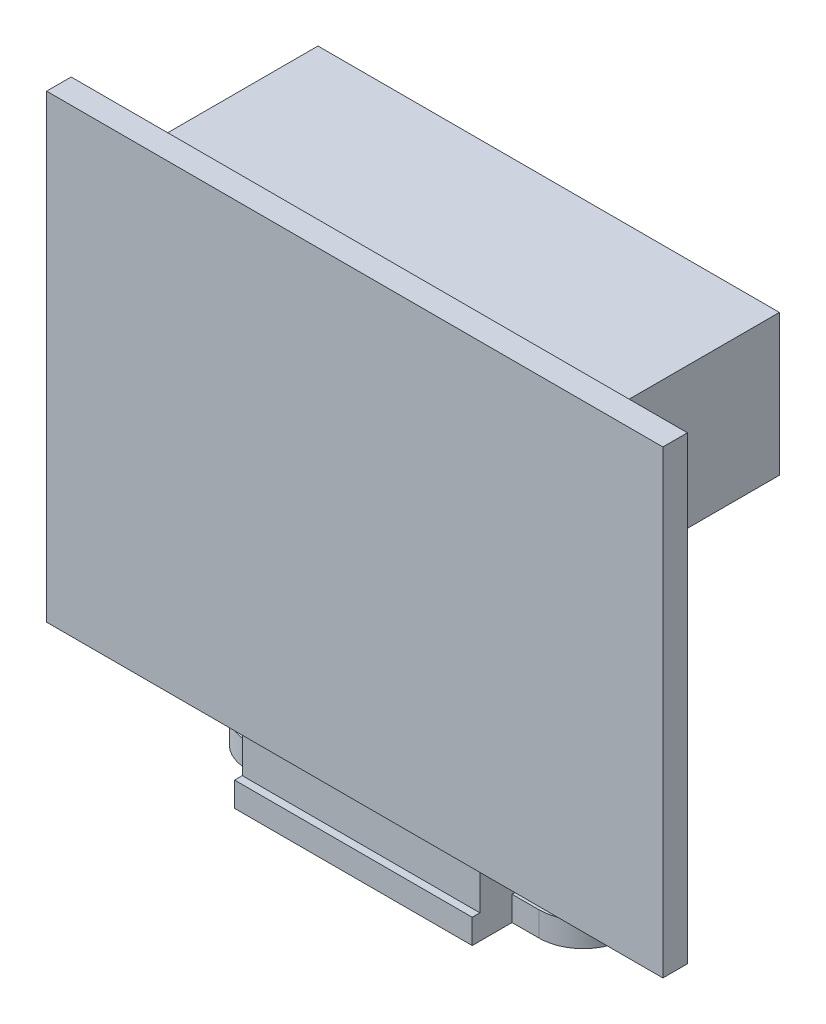
ISO-10303-21;
HEADER;
FILE_DESCRIPTION(('STEP AP214'),'2;1');
FILE_NAME('part.step','',(''),(''),'','','');
FILE_SCHEMA(('AUTOMOTIVE_DESIGN { 1 0 10303 214 1 1 1 1 }'));
ENDSEC;
DATA;
#1=APPLICATION_CONTEXT('core data for automotive mechanical design processes');
#2=APPLICATION_PROTOCOL_DEFINITION('international standard','automotive_design',2000,#1);
#3=PRODUCT_CONTEXT('',#1,'mechanical');
#4=PRODUCT('Part','Part','',(#3));
#5=PRODUCT_RELATED_PRODUCT_CATEGORY('part','',(#4));
#6=PRODUCT_DEFINITION_FORMATION('','',#4);
#7=PRODUCT_DEFINITION_CONTEXT('part definition',#1,'design');
#8=PRODUCT_DEFINITION('design','',#6,#7);
#9=PRODUCT_DEFINITION_SHAPE('','',#8);
#10=(LENGTH_UNIT() NAMED_UNIT(*) SI_UNIT(.MILLI.,.METRE.));
#11=(NAMED_UNIT(*) PLANE_ANGLE_UNIT() SI_UNIT($,.RADIAN.));
#12=(NAMED_UNIT(*) SI_UNIT($,.STERADIAN.) SOLID_ANGLE_UNIT());
#13=UNCERTAINTY_MEASURE_WITH_UNIT(LENGTH_MEASURE(1.E-05),#10,'distance_accuracy_value','');
#14=(GEOMETRIC_REPRESENTATION_CONTEXT(3) GLOBAL_UNCERTAINTY_ASSIGNED_CONTEXT((#13)) GLOBAL_UNIT_ASSIGNED_CONTEXT((#10,
#11,#12)) REPRESENTATION_CONTEXT('',''));
#15=CARTESIAN_POINT('',(0.,0.,0.));
#16=DIRECTION('',(0.,0.,1.));
#17=DIRECTION('',(1.,0.,0.));
#18=AXIS2_PLACEMENT_3D('',#15,#16,#17);
#19=CARTESIAN_POINT('',(-12.35,34.3,9.31228147882347));
#20=DIRECTION('',(0.,0.,1.));
#21=DIRECTION('',(1.,0.,0.));
#22=AXIS2_PLACEMENT_3D('',#19,#20,#21);
#23=PLANE('',#22);
#24=DIRECTION('',(-1.,0.,0.));
#25=VECTOR('',#24,1.);
#26=CARTESIAN_POINT('',(-12.35,4.3,9.31228147882347));
#27=LINE('',#26,#25);
#28=CARTESIAN_POINT('',(27.85,4.3,9.31228147882347));
#29=VERTEX_POINT('',#28);
#30=CARTESIAN_POINT('',(15.5,4.3,9.31228147882347));
#31=VERTEX_POINT('',#30);
#32=EDGE_CURVE('E48',#29,#31,#27,.T.);
#33=ORIENTED_EDGE('',*,*,#32,.T.);
#34=CARTESIAN_POINT('',(0.,4.3,9.31228147882347));
#35=VERTEX_POINT('',#34);
#36=EDGE_CURVE('E11',#31,#35,#27,.T.);
#37=ORIENTED_EDGE('',*,*,#36,.T.);
#38=CARTESIAN_POINT('',(-12.35,4.3,9.31228147882347));
#39=VERTEX_POINT('',#38);
#40=EDGE_CURVE('E49',#35,#39,#27,.T.);
#41=ORIENTED_EDGE('',*,*,#40,.T.);
#42=DIRECTION('',(0.,-1.,0.));
#43=VECTOR('',#42,1.);
#44=CARTESIAN_POINT('',(-12.35,34.3,9.31228147882347));
#45=LINE('',#44,#43);
#46=CARTESIAN_POINT('',(-12.35,34.3,9.31228147882347));
#47=VERTEX_POINT('',#46);
#48=EDGE_CURVE('E257',#47,#39,#45,.T.);
#49=ORIENTED_EDGE('',*,*,#48,.F.);
#50=DIRECTION('',(-1.,0.,0.));
#51=VECTOR('',#50,1.);
#52=CARTESIAN_POINT('',(-12.35,34.3,9.31228147882347));
#53=LINE('',#52,#51);
#54=CARTESIAN_POINT('',(27.85,34.3,9.31228147882347));
#55=VERTEX_POINT('',#54);
#56=EDGE_CURVE('E240',#55,#47,#53,.T.);
#57=ORIENTED_EDGE('',*,*,#56,.F.);
#58=DIRECTION('',(0.,-1.,0.));
#59=VECTOR('',#58,1.);
#60=CARTESIAN_POINT('',(27.85,34.3,9.31228147882347));
#61=LINE('',#60,#59);
#62=EDGE_CURVE('E260',#55,#29,#61,.T.);
#63=ORIENTED_EDGE('',*,*,#62,.T.);
#64=EDGE_LOOP('',(#33,#37,#41,#49,#57,#63));
#65=FACE_BOUND('',#64,.T.);
#66=DIRECTION('',(0.,-1.,0.));
#67=VECTOR('',#66,1.);
#68=CARTESIAN_POINT('',(21.75,22.8,9.31228147882347));
#69=LINE('',#68,#67);
#70=CARTESIAN_POINT('',(21.75,32.,9.31228147882347));
#71=VERTEX_POINT('',#70);
#72=CARTESIAN_POINT('',(21.75,22.8,9.31228147882347));
#73=VERTEX_POINT('',#72);
#74=EDGE_CURVE('E228',#71,#73,#69,.T.);
#75=ORIENTED_EDGE('',*,*,#74,.F.);
#76=DIRECTION('',(1.,0.,0.));
#77=VECTOR('',#76,1.);
#78=CARTESIAN_POINT('',(21.75,32.,9.31228147882347));
#79=LINE('',#78,#77);
#80=CARTESIAN_POINT('',(-8.35,32.,9.31228147882347));
#81=VERTEX_POINT('',#80);
#82=EDGE_CURVE('E225',#81,#71,#79,.T.);
#83=ORIENTED_EDGE('',*,*,#82,.F.);
#84=DIRECTION('',(0.,1.,0.));
#85=VECTOR('',#84,1.);
#86=CARTESIAN_POINT('',(-8.35,22.8,9.31228147882347));
#87=LINE('',#86,#85);
#88=CARTESIAN_POINT('',(-8.35,22.8,9.31228147882347));
#89=VERTEX_POINT('',#88);
#90=EDGE_CURVE('E61',#89,#81,#87,.T.);
#91=ORIENTED_EDGE('',*,*,#90,.F.);
#92=DIRECTION('',(-1.,0.,0.));
#93=VECTOR('',#92,1.);
#94=CARTESIAN_POINT('',(21.75,22.8,9.31228147882347));
#95=LINE('',#94,#93);
#96=EDGE_CURVE('E56',#73,#89,#95,.T.);
#97=ORIENTED_EDGE('',*,*,#96,.F.);
#98=EDGE_LOOP('',(#75,#83,#91,#97));
#99=FACE_BOUND('',#98,.T.);
#100=ADVANCED_FACE('F37',(#65,#99),#23,.F.);
#101=CARTESIAN_POINT('',(0.,4.3,0.));
#102=DIRECTION('',(0.,-1.,0.));
#103=DIRECTION('',(0.,0.,-1.));
#104=AXIS2_PLACEMENT_3D('',#101,#102,#103);
#105=PLANE('',#104);
#106=ORIENTED_EDGE('',*,*,#36,.F.);
#107=DIRECTION('',(0.,0.,-1.));
#108=VECTOR('',#107,1.);
#109=CARTESIAN_POINT('',(15.5,4.3,10.5));
#110=LINE('',#109,#108);
#111=CARTESIAN_POINT('',(15.5,4.3,7.80000000000001));
#112=VERTEX_POINT('',#111);
#113=EDGE_CURVE('E268',#31,#112,#110,.T.);
#114=ORIENTED_EDGE('',*,*,#113,.T.);
#115=DIRECTION('',(-1.,0.,0.));
#116=VECTOR('',#115,1.);
#117=CARTESIAN_POINT('',(0.,4.3,7.80000000000001));
#118=LINE('',#117,#116);
#119=CARTESIAN_POINT('',(0.,4.3,7.80000000000001));
#120=VERTEX_POINT('',#119);
#121=EDGE_CURVE('E267',#112,#120,#118,.T.);
#122=ORIENTED_EDGE('',*,*,#121,.T.);
#123=DIRECTION('',(0.,0.,1.));
#124=VECTOR('',#123,1.);
#125=CARTESIAN_POINT('',(0.,4.3,10.5));
#126=LINE('',#125,#124);
#127=EDGE_CURVE('E271',#120,#35,#126,.T.);
#128=ORIENTED_EDGE('',*,*,#127,.T.);
#129=EDGE_LOOP('',(#106,#114,#122,#128));
#130=FACE_BOUND('',#129,.T.);
#131=ADVANCED_FACE('F431',(#130),#105,.F.);
#132=CARTESIAN_POINT('',(0.,1.6,0.));
#133=DIRECTION('',(0.,1.,0.));
#134=DIRECTION('',(0.,0.,1.));
#135=AXIS2_PLACEMENT_3D('',#132,#133,#134);
#136=PLANE('',#135);
#137=DIRECTION('',(1.,0.,0.));
#138=VECTOR('',#137,1.);
#139=CARTESIAN_POINT('',(0.,1.6,10.5));
#140=LINE('',#139,#138);
#141=CARTESIAN_POINT('',(0.,1.6,10.5));
#142=VERTEX_POINT('',#141);
#143=CARTESIAN_POINT('',(15.5,1.6,10.5));
#144=VERTEX_POINT('',#143);
#145=EDGE_CURVE('E284',#142,#144,#140,.T.);
#146=ORIENTED_EDGE('',*,*,#145,.F.);
#147=DIRECTION('',(0.,0.,1.));
#148=VECTOR('',#147,1.);
#149=CARTESIAN_POINT('',(0.,1.6,0.));
#150=LINE('',#149,#148);
#151=CARTESIAN_POINT('',(0.,1.6,11.));
#152=VERTEX_POINT('',#151);
#153=EDGE_CURVE('E366',#142,#152,#150,.T.);
#154=ORIENTED_EDGE('',*,*,#153,.T.);
#155=DIRECTION('',(1.,0.,0.));
#156=VECTOR('',#155,1.);
#157=CARTESIAN_POINT('',(0.,1.6,11.));
#158=LINE('',#157,#156);
#159=CARTESIAN_POINT('',(15.5,1.6,11.));
#160=VERTEX_POINT('',#159);
#161=EDGE_CURVE('E365',#152,#160,#158,.T.);
#162=ORIENTED_EDGE('',*,*,#161,.T.);
#163=DIRECTION('',(0.,0.,-1.));
#164=VECTOR('',#163,1.);
#165=CARTESIAN_POINT('',(15.5,1.6,0.));
#166=LINE('',#165,#164);
#167=EDGE_CURVE('E369',#160,#144,#166,.T.);
#168=ORIENTED_EDGE('',*,*,#167,.T.);
#169=EDGE_LOOP('',(#146,#154,#162,#168));
#170=FACE_BOUND('',#169,.T.);
#171=ADVANCED_FACE('F471',(#170),#136,.T.);
#172=CARTESIAN_POINT('',(15.5,1.6,0.));
#173=DIRECTION('',(-1.,0.,0.));
#174=DIRECTION('',(0.,0.,1.));
#175=AXIS2_PLACEMENT_3D('',#172,#173,#174);
#176=PLANE('',#175);
#177=DIRECTION('',(0.,1.,0.));
#178=VECTOR('',#177,1.);
#179=CARTESIAN_POINT('',(15.5,0.,2.6));
#180=LINE('',#179,#178);
#181=CARTESIAN_POINT('',(15.5,0.,2.6));
#182=VERTEX_POINT('',#181);
#183=CARTESIAN_POINT('',(15.5,1.6,2.6));
#184=VERTEX_POINT('',#183);
#185=EDGE_CURVE('E322',#182,#184,#180,.T.);
#186=ORIENTED_EDGE('',*,*,#185,.F.);
#187=DIRECTION('',(0.,0.,-1.));
#188=VECTOR('',#187,1.);
#189=CARTESIAN_POINT('',(15.5,0.,0.));
#190=LINE('',#189,#188);
#191=CARTESIAN_POINT('',(15.5,0.,0.));
#192=VERTEX_POINT('',#191);
#193=EDGE_CURVE('E379',#182,#192,#190,.T.);
#194=ORIENTED_EDGE('',*,*,#193,.T.);
#195=DIRECTION('',(0.,-1.,0.));
#196=VECTOR('',#195,1.);
#197=CARTESIAN_POINT('',(15.5,1.6,0.));
#198=LINE('',#197,#196);
#199=CARTESIAN_POINT('',(15.5,1.6,0.));
#200=VERTEX_POINT('',#199);
#201=EDGE_CURVE('E387',#200,#192,#198,.T.);
#202=ORIENTED_EDGE('',*,*,#201,.F.);
#203=EDGE_CURVE('E368',#184,#200,#166,.T.);
#204=ORIENTED_EDGE('',*,*,#203,.F.);
#205=EDGE_LOOP('',(#186,#194,#202,#204));
#206=FACE_BOUND('',#205,.T.);
#207=ADVANCED_FACE('F522',(#206),#176,.F.);
#208=CARTESIAN_POINT('',(0.,1.6,0.));
#209=DIRECTION('',(1.,0.,0.));
#210=DIRECTION('',(0.,0.,-1.));
#211=AXIS2_PLACEMENT_3D('',#208,#209,#210);
#212=PLANE('',#211);
#213=DIRECTION('',(0.,1.,0.));
#214=VECTOR('',#213,1.);
#215=CARTESIAN_POINT('',(0.,0.,8.4));
#216=LINE('',#215,#214);
#217=CARTESIAN_POINT('',(0.,0.,8.4));
#218=VERTEX_POINT('',#217);
#219=CARTESIAN_POINT('',(0.,1.6,8.4));
#220=VERTEX_POINT('',#219);
#221=EDGE_CURVE('E353',#218,#220,#216,.T.);
#222=ORIENTED_EDGE('',*,*,#221,.F.);
#223=DIRECTION('',(0.,0.,1.));
#224=VECTOR('',#223,1.);
#225=CARTESIAN_POINT('',(0.,0.,0.));
#226=LINE('',#225,#224);
#227=CARTESIAN_POINT('',(0.,0.,11.));
#228=VERTEX_POINT('',#227);
#229=EDGE_CURVE('E355',#218,#228,#226,.T.);
#230=ORIENTED_EDGE('',*,*,#229,.T.);
#231=DIRECTION('',(0.,-1.,0.));
#232=VECTOR('',#231,1.);
#233=CARTESIAN_POINT('',(0.,1.6,11.));
#234=LINE('',#233,#232);
#235=EDGE_CURVE('E41',#152,#228,#234,.T.);
#236=ORIENTED_EDGE('',*,*,#235,.F.);
#237=ORIENTED_EDGE('',*,*,#153,.F.);
#238=DIRECTION('',(0.,-1.,0.));
#239=VECTOR('',#238,1.);
#240=CARTESIAN_POINT('',(0.,4.3,10.5));
#241=LINE('',#240,#239);
#242=CARTESIAN_POINT('',(0.,4.3,10.5));
#243=VERTEX_POINT('',#242);
#244=EDGE_CURVE('E289',#243,#142,#241,.T.);
#245=ORIENTED_EDGE('',*,*,#244,.F.);
#246=EDGE_CURVE('E270',#35,#243,#126,.T.);
#247=ORIENTED_EDGE('',*,*,#246,.F.);
#248=ORIENTED_EDGE('',*,*,#127,.F.);
#249=DIRECTION('',(0.,-1.,0.));
#250=VECTOR('',#249,1.);
#251=CARTESIAN_POINT('',(0.,4.3,7.80000000000001));
#252=LINE('',#251,#250);
#253=CARTESIAN_POINT('',(0.,1.6,7.80000000000001));
#254=VERTEX_POINT('',#253);
#255=EDGE_CURVE('E292',#120,#254,#252,.T.);
#256=ORIENTED_EDGE('',*,*,#255,.T.);
#257=DIRECTION('',(0.,0.,1.));
#258=VECTOR('',#257,1.);
#259=CARTESIAN_POINT('',(0.,1.6,10.5));
#260=LINE('',#259,#258);
#261=EDGE_CURVE('E281',#254,#220,#260,.T.);
#262=ORIENTED_EDGE('',*,*,#261,.T.);
#263=EDGE_LOOP('',(#222,#230,#236,#237,#245,#247,#248,#256,#262));
#264=FACE_BOUND('',#263,.T.);
#265=ADVANCED_FACE('F404',(#264),#212,.F.);
#266=CARTESIAN_POINT('',(0.,0.,0.));
#267=VERTEX_POINT('',#266);
#268=CARTESIAN_POINT('',(0.,0.,2.6));
#269=VERTEX_POINT('',#268);
#270=EDGE_CURVE('E374',#267,#269,#226,.T.);
#271=ORIENTED_EDGE('',*,*,#270,.T.);
#272=DIRECTION('',(0.,1.,0.));
#273=VECTOR('',#272,1.);
#274=CARTESIAN_POINT('',(0.,0.,2.6));
#275=LINE('',#274,#273);
#276=CARTESIAN_POINT('',(0.,1.6,2.6));
#277=VERTEX_POINT('',#276);
#278=EDGE_CURVE('E343',#269,#277,#275,.T.);
#279=ORIENTED_EDGE('',*,*,#278,.T.);
#280=CARTESIAN_POINT('',(0.,1.6,0.));
#281=VERTEX_POINT('',#280);
#282=EDGE_CURVE('E362',#281,#277,#150,.T.);
#283=ORIENTED_EDGE('',*,*,#282,.F.);
#284=DIRECTION('',(0.,-1.,0.));
#285=VECTOR('',#284,1.);
#286=CARTESIAN_POINT('',(0.,1.6,0.));
#287=LINE('',#286,#285);
#288=EDGE_CURVE('E373',#281,#267,#287,.T.);
#289=ORIENTED_EDGE('',*,*,#288,.T.);
#290=EDGE_LOOP('',(#271,#279,#283,#289));
#291=FACE_BOUND('',#290,.T.);
#292=ADVANCED_FACE('F39',(#291),#212,.F.);
#293=CARTESIAN_POINT('',(0.,1.6,11.));
#294=DIRECTION('',(0.,0.,-1.));
#295=DIRECTION('',(-1.,0.,0.));
#296=AXIS2_PLACEMENT_3D('',#293,#294,#295);
#297=PLANE('',#296);
#298=DIRECTION('',(1.,0.,0.));
#299=VECTOR('',#298,1.);
#300=CARTESIAN_POINT('',(0.,0.,11.));
#301=LINE('',#300,#299);
#302=CARTESIAN_POINT('',(15.5,0.,11.));
#303=VERTEX_POINT('',#302);
#304=EDGE_CURVE('E377',#228,#303,#301,.T.);
#305=ORIENTED_EDGE('',*,*,#304,.T.);
#306=DIRECTION('',(0.,-1.,0.));
#307=VECTOR('',#306,1.);
#308=CARTESIAN_POINT('',(15.5,1.6,11.));
#309=LINE('',#308,#307);
#310=EDGE_CURVE('E389',#160,#303,#309,.T.);
#311=ORIENTED_EDGE('',*,*,#310,.F.);
#312=ORIENTED_EDGE('',*,*,#161,.F.);
#313=ORIENTED_EDGE('',*,*,#235,.T.);
#314=EDGE_LOOP('',(#305,#311,#312,#313));
#315=FACE_BOUND('',#314,.T.);
#316=ADVANCED_FACE('F399',(#315),#297,.F.);
#317=CARTESIAN_POINT('',(15.5,0.,8.4));
#318=VERTEX_POINT('',#317);
#319=EDGE_CURVE('E380',#303,#318,#190,.T.);
#320=ORIENTED_EDGE('',*,*,#319,.T.);
#321=DIRECTION('',(0.,1.,0.));
#322=VECTOR('',#321,1.);
#323=CARTESIAN_POINT('',(15.5,0.,8.4));
#324=LINE('',#323,#322);
#325=CARTESIAN_POINT('',(15.5,1.6,8.4));
#326=VERTEX_POINT('',#325);
#327=EDGE_CURVE('E311',#318,#326,#324,.T.);
#328=ORIENTED_EDGE('',*,*,#327,.T.);
#329=DIRECTION('',(0.,0.,-1.));
#330=VECTOR('',#329,1.);
#331=CARTESIAN_POINT('',(15.5,1.6,10.5));
#332=LINE('',#331,#330);
#333=CARTESIAN_POINT('',(15.5,1.6,7.80000000000001));
#334=VERTEX_POINT('',#333);
#335=EDGE_CURVE('E46',#326,#334,#332,.T.);
#336=ORIENTED_EDGE('',*,*,#335,.T.);
#337=DIRECTION('',(0.,-1.,0.));
#338=VECTOR('',#337,1.);
#339=CARTESIAN_POINT('',(15.5,4.3,7.80000000000001));
#340=LINE('',#339,#338);
#341=EDGE_CURVE('E295',#112,#334,#340,.T.);
#342=ORIENTED_EDGE('',*,*,#341,.F.);
#343=ORIENTED_EDGE('',*,*,#113,.F.);
#344=CARTESIAN_POINT('',(15.5,4.3,10.5));
#345=VERTEX_POINT('',#344);
#346=EDGE_CURVE('E264',#345,#31,#110,.T.);
#347=ORIENTED_EDGE('',*,*,#346,.F.);
#348=DIRECTION('',(0.,-1.,0.));
#349=VECTOR('',#348,1.);
#350=CARTESIAN_POINT('',(15.5,4.3,10.5));
#351=LINE('',#350,#349);
#352=EDGE_CURVE('E276',#345,#144,#351,.T.);
#353=ORIENTED_EDGE('',*,*,#352,.T.);
#354=ORIENTED_EDGE('',*,*,#167,.F.);
#355=ORIENTED_EDGE('',*,*,#310,.T.);
#356=EDGE_LOOP('',(#320,#328,#336,#342,#343,#347,#353,#354,#355));
#357=FACE_BOUND('',#356,.T.);
#358=ADVANCED_FACE('F413',(#357),#176,.F.);
#359=CARTESIAN_POINT('',(0.,1.6,0.));
#360=DIRECTION('',(0.,0.,1.));
#361=DIRECTION('',(1.,0.,0.));
#362=AXIS2_PLACEMENT_3D('',#359,#360,#361);
#363=PLANE('',#362);
#364=DIRECTION('',(-1.,0.,0.));
#365=VECTOR('',#364,1.);
#366=CARTESIAN_POINT('',(0.,0.,0.));
#367=LINE('',#366,#365);
#368=EDGE_CURVE('E383',#192,#267,#367,.T.);
#369=ORIENTED_EDGE('',*,*,#368,.T.);
#370=ORIENTED_EDGE('',*,*,#288,.F.);
#371=DIRECTION('',(-1.,0.,0.));
#372=VECTOR('',#371,1.);
#373=CARTESIAN_POINT('',(0.,1.6,0.));
#374=LINE('',#373,#372);
#375=EDGE_CURVE('E371',#200,#281,#374,.T.);
#376=ORIENTED_EDGE('',*,*,#375,.F.);
#377=ORIENTED_EDGE('',*,*,#201,.T.);
#378=EDGE_LOOP('',(#369,#370,#376,#377));
#379=FACE_BOUND('',#378,.T.);
#380=ADVANCED_FACE('F515',(#379),#363,.F.);
#381=ORIENTED_EDGE('',*,*,#335,.F.);
#382=DIRECTION('',(1.,0.,0.));
#383=VECTOR('',#382,1.);
#384=CARTESIAN_POINT('',(0.,1.6,8.4));
#385=LINE('',#384,#383);
#386=CARTESIAN_POINT('',(17.25,1.6,8.4));
#387=VERTEX_POINT('',#386);
#388=EDGE_CURVE('E298',#326,#387,#385,.T.);
#389=ORIENTED_EDGE('',*,*,#388,.T.);
#390=CARTESIAN_POINT('',(17.25,1.6,5.50000000000001));
#391=DIRECTION('',(0.,1.,0.));
#392=DIRECTION('',(0.,0.,1.));
#393=AXIS2_PLACEMENT_3D('',#390,#391,#392);
#394=CIRCLE('',#393,2.9);
#395=CARTESIAN_POINT('',(17.25,1.6,2.6));
#396=VERTEX_POINT('',#395);
#397=EDGE_CURVE('E314',#387,#396,#394,.T.);
#398=ORIENTED_EDGE('',*,*,#397,.T.);
#399=DIRECTION('',(1.,0.,0.));
#400=VECTOR('',#399,1.);
#401=CARTESIAN_POINT('',(0.,1.6,2.6));
#402=LINE('',#401,#400);
#403=EDGE_CURVE('E317',#184,#396,#402,.T.);
#404=ORIENTED_EDGE('',*,*,#403,.F.);
#405=ORIENTED_EDGE('',*,*,#203,.T.);
#406=ORIENTED_EDGE('',*,*,#375,.T.);
#407=ORIENTED_EDGE('',*,*,#282,.T.);
#408=DIRECTION('',(1.,0.,0.));
#409=VECTOR('',#408,1.);
#410=CARTESIAN_POINT('',(0.,1.6,2.6));
#411=LINE('',#410,#409);
#412=CARTESIAN_POINT('',(-1.74999999999999,1.6,2.6));
#413=VERTEX_POINT('',#412);
#414=EDGE_CURVE('E346',#413,#277,#411,.T.);
#415=ORIENTED_EDGE('',*,*,#414,.F.);
#416=CARTESIAN_POINT('',(-1.74999999999999,1.6,5.50000000000001));
#417=DIRECTION('',(0.,1.,0.));
#418=DIRECTION('',(0.,0.,1.));
#419=AXIS2_PLACEMENT_3D('',#416,#417,#418);
#420=CIRCLE('',#419,2.9);
#421=CARTESIAN_POINT('',(-1.74999999999999,1.6,8.4));
#422=VERTEX_POINT('',#421);
#423=EDGE_CURVE('E348',#413,#422,#420,.T.);
#424=ORIENTED_EDGE('',*,*,#423,.T.);
#425=DIRECTION('',(1.,0.,0.));
#426=VECTOR('',#425,1.);
#427=CARTESIAN_POINT('',(0.,1.6,8.4));
#428=LINE('',#427,#426);
#429=EDGE_CURVE('E336',#422,#220,#428,.T.);
#430=ORIENTED_EDGE('',*,*,#429,.T.);
#431=ORIENTED_EDGE('',*,*,#261,.F.);
#432=DIRECTION('',(-1.,0.,0.));
#433=VECTOR('',#432,1.);
#434=CARTESIAN_POINT('',(0.,1.6,7.80000000000001));
#435=LINE('',#434,#433);
#436=EDGE_CURVE('E263',#334,#254,#435,.T.);
#437=ORIENTED_EDGE('',*,*,#436,.F.);
#438=EDGE_LOOP('',(#381,#389,#398,#404,#405,#406,#407,#415,#424,#430,#431,#437));
#439=FACE_BOUND('',#438,.T.);
#440=CARTESIAN_POINT('',(-1.74999999999999,1.6,5.50000000000001));
#441=DIRECTION('',(0.,1.,0.));
#442=DIRECTION('',(0.,0.,1.));
#443=AXIS2_PLACEMENT_3D('',#440,#441,#442);
#444=CIRCLE('',#443,1.5);
#445=CARTESIAN_POINT('',(-1.74999999999999,1.6,7.00000000000001));
#446=VERTEX_POINT('',#445);
#447=EDGE_CURVE('E325',#446,#446,#444,.T.);
#448=ORIENTED_EDGE('',*,*,#447,.F.);
#449=EDGE_LOOP('',(#448));
#450=FACE_BOUND('',#449,.T.);
#451=CARTESIAN_POINT('',(17.25,1.6,5.50000000000001));
#452=DIRECTION('',(0.,1.,0.));
#453=DIRECTION('',(0.,0.,1.));
#454=AXIS2_PLACEMENT_3D('',#451,#452,#453);
#455=CIRCLE('',#454,1.5);
#456=CARTESIAN_POINT('',(17.25,1.6,7.00000000000001));
#457=VERTEX_POINT('',#456);
#458=EDGE_CURVE('E303',#457,#457,#455,.T.);
#459=ORIENTED_EDGE('',*,*,#458,.F.);
#460=EDGE_LOOP('',(#459));
#461=FACE_BOUND('',#460,.T.);
#462=ADVANCED_FACE('F420',(#439,#450,#461),#136,.T.);
#463=CARTESIAN_POINT('',(0.,0.,0.));
#464=DIRECTION('',(0.,1.,0.));
#465=DIRECTION('',(0.,0.,1.));
#466=AXIS2_PLACEMENT_3D('',#463,#464,#465);
#467=PLANE('',#466);
#468=ORIENTED_EDGE('',*,*,#270,.F.);
#469=ORIENTED_EDGE('',*,*,#368,.F.);
#470=ORIENTED_EDGE('',*,*,#193,.F.);
#471=DIRECTION('',(1.,0.,0.));
#472=VECTOR('',#471,1.);
#473=CARTESIAN_POINT('',(0.,0.,2.6));
#474=LINE('',#473,#472);
#475=CARTESIAN_POINT('',(17.25,0.,2.6));
#476=VERTEX_POINT('',#475);
#477=EDGE_CURVE('E306',#182,#476,#474,.T.);
#478=ORIENTED_EDGE('',*,*,#477,.T.);
#479=CARTESIAN_POINT('',(17.25,0.,5.50000000000001));
#480=DIRECTION('',(0.,1.,0.));
#481=DIRECTION('',(0.,0.,1.));
#482=AXIS2_PLACEMENT_3D('',#479,#480,#481);
#483=CIRCLE('',#482,2.9);
#484=CARTESIAN_POINT('',(17.25,0.,8.4));
#485=VERTEX_POINT('',#484);
#486=EDGE_CURVE('E302',#485,#476,#483,.T.);
#487=ORIENTED_EDGE('',*,*,#486,.F.);
#488=DIRECTION('',(1.,0.,0.));
#489=VECTOR('',#488,1.);
#490=CARTESIAN_POINT('',(0.,0.,8.4));
#491=LINE('',#490,#489);
#492=EDGE_CURVE('E299',#318,#485,#491,.T.);
#493=ORIENTED_EDGE('',*,*,#492,.F.);
#494=ORIENTED_EDGE('',*,*,#319,.F.);
#495=ORIENTED_EDGE('',*,*,#304,.F.);
#496=ORIENTED_EDGE('',*,*,#229,.F.);
#497=DIRECTION('',(1.,0.,0.));
#498=VECTOR('',#497,1.);
#499=CARTESIAN_POINT('',(0.,0.,8.4));
#500=LINE('',#499,#498);
#501=CARTESIAN_POINT('',(-1.74999999999999,0.,8.4));
#502=VERTEX_POINT('',#501);
#503=EDGE_CURVE('E341',#502,#218,#500,.T.);
#504=ORIENTED_EDGE('',*,*,#503,.F.);
#505=CARTESIAN_POINT('',(-1.74999999999999,0.,5.50000000000001));
#506=DIRECTION('',(0.,1.,0.));
#507=DIRECTION('',(0.,0.,1.));
#508=AXIS2_PLACEMENT_3D('',#505,#506,#507);
#509=CIRCLE('',#508,2.9);
#510=CARTESIAN_POINT('',(-1.74999999999999,0.,2.6));
#511=VERTEX_POINT('',#510);
#512=EDGE_CURVE('E338',#511,#502,#509,.T.);
#513=ORIENTED_EDGE('',*,*,#512,.F.);
#514=DIRECTION('',(1.,0.,0.));
#515=VECTOR('',#514,1.);
#516=CARTESIAN_POINT('',(0.,0.,2.6));
#517=LINE('',#516,#515);
#518=EDGE_CURVE('E335',#511,#269,#517,.T.);
#519=ORIENTED_EDGE('',*,*,#518,.T.);
#520=EDGE_LOOP('',(#468,#469,#470,#478,#487,#493,#494,#495,#496,#504,#513,#519));
#521=FACE_BOUND('',#520,.T.);
#522=CARTESIAN_POINT('',(-1.74999999999999,0.,5.50000000000001));
#523=DIRECTION('',(0.,1.,0.));
#524=DIRECTION('',(0.,0.,1.));
#525=AXIS2_PLACEMENT_3D('',#522,#523,#524);
#526=CIRCLE('',#525,1.5);
#527=CARTESIAN_POINT('',(-1.74999999999999,0.,7.00000000000001));
#528=VERTEX_POINT('',#527);
#529=EDGE_CURVE('E332',#528,#528,#526,.T.);
#530=ORIENTED_EDGE('',*,*,#529,.T.);
#531=EDGE_LOOP('',(#530));
#532=FACE_BOUND('',#531,.T.);
#533=CARTESIAN_POINT('',(17.25,0.,5.50000000000001));
#534=DIRECTION('',(0.,1.,0.));
#535=DIRECTION('',(0.,0.,1.));
#536=AXIS2_PLACEMENT_3D('',#533,#534,#535);
#537=CIRCLE('',#536,1.5);
#538=CARTESIAN_POINT('',(17.25,0.,7.00000000000001));
#539=VERTEX_POINT('',#538);
#540=EDGE_CURVE('E308',#539,#539,#537,.T.);
#541=ORIENTED_EDGE('',*,*,#540,.T.);
#542=EDGE_LOOP('',(#541));
#543=FACE_BOUND('',#542,.T.);
#544=ADVANCED_FACE('F409',(#521,#532,#543),#467,.F.);
#545=CARTESIAN_POINT('',(0.,0.,8.4));
#546=DIRECTION('',(0.,0.,1.));
#547=DIRECTION('',(1.,0.,0.));
#548=AXIS2_PLACEMENT_3D('',#545,#546,#547);
#549=PLANE('',#548);
#550=ORIENTED_EDGE('',*,*,#429,.F.);
#551=DIRECTION('',(0.,1.,0.));
#552=VECTOR('',#551,1.);
#553=CARTESIAN_POINT('',(-1.74999999999999,0.,8.4));
#554=LINE('',#553,#552);
#555=EDGE_CURVE('E356',#502,#422,#554,.T.);
#556=ORIENTED_EDGE('',*,*,#555,.F.);
#557=ORIENTED_EDGE('',*,*,#503,.T.);
#558=ORIENTED_EDGE('',*,*,#221,.T.);
#559=EDGE_LOOP('',(#550,#556,#557,#558));
#560=FACE_BOUND('',#559,.T.);
#561=ADVANCED_FACE('F498',(#560),#549,.T.);
#562=CARTESIAN_POINT('',(-1.74999999999999,0.,5.50000000000001));
#563=DIRECTION('',(0.,1.,0.));
#564=DIRECTION('',(0.,0.,1.));
#565=AXIS2_PLACEMENT_3D('',#562,#563,#564);
#566=CYLINDRICAL_SURFACE('',#565,2.9);
#567=ORIENTED_EDGE('',*,*,#423,.F.);
#568=DIRECTION('',(0.,1.,0.));
#569=VECTOR('',#568,1.);
#570=CARTESIAN_POINT('',(-1.74999999999999,0.,2.6));
#571=LINE('',#570,#569);
#572=EDGE_CURVE('E358',#511,#413,#571,.T.);
#573=ORIENTED_EDGE('',*,*,#572,.F.);
#574=ORIENTED_EDGE('',*,*,#512,.T.);
#575=ORIENTED_EDGE('',*,*,#555,.T.);
#576=EDGE_LOOP('',(#567,#573,#574,#575));
#577=FACE_BOUND('',#576,.T.);
#578=ADVANCED_FACE('F501',(#577),#566,.T.);
#579=CARTESIAN_POINT('',(-1.74999999999999,0.,5.50000000000001));
#580=DIRECTION('',(0.,1.,0.));
#581=DIRECTION('',(0.,0.,1.));
#582=AXIS2_PLACEMENT_3D('',#579,#580,#581);
#583=CYLINDRICAL_SURFACE('',#582,1.5);
#584=ORIENTED_EDGE('',*,*,#529,.F.);
#585=EDGE_LOOP('',(#584));
#586=FACE_BOUND('',#585,.T.);
#587=ORIENTED_EDGE('',*,*,#447,.T.);
#588=EDGE_LOOP('',(#587));
#589=FACE_BOUND('',#588,.T.);
#590=ADVANCED_FACE('F505',(#586,#589),#583,.F.);
#591=CARTESIAN_POINT('',(0.,0.,2.6));
#592=DIRECTION('',(0.,0.,1.));
#593=DIRECTION('',(1.,0.,0.));
#594=AXIS2_PLACEMENT_3D('',#591,#592,#593);
#595=PLANE('',#594);
#596=ORIENTED_EDGE('',*,*,#414,.T.);
#597=ORIENTED_EDGE('',*,*,#278,.F.);
#598=ORIENTED_EDGE('',*,*,#518,.F.);
#599=ORIENTED_EDGE('',*,*,#572,.T.);
#600=EDGE_LOOP('',(#596,#597,#598,#599));
#601=FACE_BOUND('',#600,.T.);
#602=ADVANCED_FACE('F491',(#601),#595,.F.);
#603=CARTESIAN_POINT('',(0.,0.,2.6));
#604=DIRECTION('',(0.,0.,1.));
#605=DIRECTION('',(1.,0.,0.));
#606=AXIS2_PLACEMENT_3D('',#603,#604,#605);
#607=PLANE('',#606);
#608=ORIENTED_EDGE('',*,*,#403,.T.);
#609=DIRECTION('',(0.,1.,0.));
#610=VECTOR('',#609,1.);
#611=CARTESIAN_POINT('',(17.25,0.,2.6));
#612=LINE('',#611,#610);
#613=EDGE_CURVE('E326',#476,#396,#612,.T.);
#614=ORIENTED_EDGE('',*,*,#613,.F.);
#615=ORIENTED_EDGE('',*,*,#477,.F.);
#616=ORIENTED_EDGE('',*,*,#185,.T.);
#617=EDGE_LOOP('',(#608,#614,#615,#616));
#618=FACE_BOUND('',#617,.T.);
#619=ADVANCED_FACE('F487',(#618),#607,.F.);
#620=CARTESIAN_POINT('',(17.25,0.,5.50000000000001));
#621=DIRECTION('',(0.,1.,0.));
#622=DIRECTION('',(0.,0.,1.));
#623=AXIS2_PLACEMENT_3D('',#620,#621,#622);
#624=CYLINDRICAL_SURFACE('',#623,2.9);
#625=ORIENTED_EDGE('',*,*,#397,.F.);
#626=DIRECTION('',(0.,1.,0.));
#627=VECTOR('',#626,1.);
#628=CARTESIAN_POINT('',(17.25,0.,8.4));
#629=LINE('',#628,#627);
#630=EDGE_CURVE('E328',#485,#387,#629,.T.);
#631=ORIENTED_EDGE('',*,*,#630,.F.);
#632=ORIENTED_EDGE('',*,*,#486,.T.);
#633=ORIENTED_EDGE('',*,*,#613,.T.);
#634=EDGE_LOOP('',(#625,#631,#632,#633));
#635=FACE_BOUND('',#634,.T.);
#636=ADVANCED_FACE('F490',(#635),#624,.T.);
#637=CARTESIAN_POINT('',(0.,0.,8.4));
#638=DIRECTION('',(0.,0.,1.));
#639=DIRECTION('',(1.,0.,0.));
#640=AXIS2_PLACEMENT_3D('',#637,#638,#639);
#641=PLANE('',#640);
#642=ORIENTED_EDGE('',*,*,#388,.F.);
#643=ORIENTED_EDGE('',*,*,#327,.F.);
#644=ORIENTED_EDGE('',*,*,#492,.T.);
#645=ORIENTED_EDGE('',*,*,#630,.T.);
#646=EDGE_LOOP('',(#642,#643,#644,#645));
#647=FACE_BOUND('',#646,.T.);
#648=ADVANCED_FACE('F417',(#647),#641,.T.);
#649=CARTESIAN_POINT('',(17.25,0.,5.50000000000001));
#650=DIRECTION('',(0.,1.,0.));
#651=DIRECTION('',(0.,0.,1.));
#652=AXIS2_PLACEMENT_3D('',#649,#650,#651);
#653=CYLINDRICAL_SURFACE('',#652,1.5);
#654=ORIENTED_EDGE('',*,*,#540,.F.);
#655=EDGE_LOOP('',(#654));
#656=FACE_BOUND('',#655,.T.);
#657=ORIENTED_EDGE('',*,*,#458,.T.);
#658=EDGE_LOOP('',(#657));
#659=FACE_BOUND('',#658,.T.);
#660=ADVANCED_FACE('F483',(#656,#659),#653,.F.);
#661=CARTESIAN_POINT('',(0.,4.3,7.80000000000001));
#662=DIRECTION('',(0.,0.,1.));
#663=DIRECTION('',(1.,0.,0.));
#664=AXIS2_PLACEMENT_3D('',#661,#662,#663);
#665=PLANE('',#664);
#666=ORIENTED_EDGE('',*,*,#436,.T.);
#667=ORIENTED_EDGE('',*,*,#255,.F.);
#668=ORIENTED_EDGE('',*,*,#121,.F.);
#669=ORIENTED_EDGE('',*,*,#341,.T.);
#670=EDGE_LOOP('',(#666,#667,#668,#669));
#671=FACE_BOUND('',#670,.T.);
#672=ADVANCED_FACE('F424',(#671),#665,.F.);
#673=CARTESIAN_POINT('',(0.,4.3,10.5));
#674=DIRECTION('',(0.,0.,-1.));
#675=DIRECTION('',(-1.,0.,0.));
#676=AXIS2_PLACEMENT_3D('',#673,#674,#675);
#677=PLANE('',#676);
#678=ORIENTED_EDGE('',*,*,#145,.T.);
#679=ORIENTED_EDGE('',*,*,#352,.F.);
#680=DIRECTION('',(1.,0.,0.));
#681=VECTOR('',#680,1.);
#682=CARTESIAN_POINT('',(0.,4.3,10.5));
#683=LINE('',#682,#681);
#684=EDGE_CURVE('E273',#243,#345,#683,.T.);
#685=ORIENTED_EDGE('',*,*,#684,.F.);
#686=ORIENTED_EDGE('',*,*,#244,.T.);
#687=EDGE_LOOP('',(#678,#679,#685,#686));
#688=FACE_BOUND('',#687,.T.);
#689=ADVANCED_FACE('F477',(#688),#677,.F.);
#690=CARTESIAN_POINT('',(0.,4.3,0.));
#691=DIRECTION('',(0.,1.,0.));
#692=DIRECTION('',(0.,0.,1.));
#693=AXIS2_PLACEMENT_3D('',#690,#691,#692);
#694=PLANE('',#693);
#695=ORIENTED_EDGE('',*,*,#684,.T.);
#696=ORIENTED_EDGE('',*,*,#346,.T.);
#697=ORIENTED_EDGE('',*,*,#32,.F.);
#698=DIRECTION('',(0.,0.,-1.));
#699=VECTOR('',#698,1.);
#700=CARTESIAN_POINT('',(27.85,4.3,9.31228147882347));
#701=LINE('',#700,#699);
#702=CARTESIAN_POINT('',(27.85,4.3,10.9122814788235));
#703=VERTEX_POINT('',#702);
#704=EDGE_CURVE('E229',#703,#29,#701,.T.);
#705=ORIENTED_EDGE('',*,*,#704,.F.);
#706=DIRECTION('',(1.,0.,0.));
#707=VECTOR('',#706,1.);
#708=CARTESIAN_POINT('',(-12.35,4.3,10.9122814788235));
#709=LINE('',#708,#707);
#710=CARTESIAN_POINT('',(-12.35,4.3,10.9122814788235));
#711=VERTEX_POINT('',#710);
#712=EDGE_CURVE('E241',#711,#703,#709,.T.);
#713=ORIENTED_EDGE('',*,*,#712,.F.);
#714=DIRECTION('',(0.,0.,1.));
#715=VECTOR('',#714,1.);
#716=CARTESIAN_POINT('',(-12.35,4.3,9.31228147882347));
#717=LINE('',#716,#715);
#718=EDGE_CURVE('E249',#39,#711,#717,.T.);
#719=ORIENTED_EDGE('',*,*,#718,.F.);
#720=ORIENTED_EDGE('',*,*,#40,.F.);
#721=ORIENTED_EDGE('',*,*,#246,.T.);
#722=EDGE_LOOP('',(#695,#696,#697,#705,#713,#719,#720,#721));
#723=FACE_BOUND('',#722,.T.);
#724=ADVANCED_FACE('F435',(#723),#694,.F.);
#725=CARTESIAN_POINT('',(27.85,34.3,9.31228147882347));
#726=DIRECTION('',(-1.,0.,0.));
#727=DIRECTION('',(0.,0.,1.));
#728=AXIS2_PLACEMENT_3D('',#725,#726,#727);
#729=PLANE('',#728);
#730=ORIENTED_EDGE('',*,*,#704,.T.);
#731=ORIENTED_EDGE('',*,*,#62,.F.);
#732=DIRECTION('',(0.,0.,-1.));
#733=VECTOR('',#732,1.);
#734=CARTESIAN_POINT('',(27.85,34.3,9.31228147882347));
#735=LINE('',#734,#733);
#736=CARTESIAN_POINT('',(27.85,34.3,10.9122814788235));
#737=VERTEX_POINT('',#736);
#738=EDGE_CURVE('E237',#737,#55,#735,.T.);
#739=ORIENTED_EDGE('',*,*,#738,.F.);
#740=DIRECTION('',(0.,-1.,0.));
#741=VECTOR('',#740,1.);
#742=CARTESIAN_POINT('',(27.85,34.3,10.9122814788235));
#743=LINE('',#742,#741);
#744=EDGE_CURVE('E246',#737,#703,#743,.T.);
#745=ORIENTED_EDGE('',*,*,#744,.T.);
#746=EDGE_LOOP('',(#730,#731,#739,#745));
#747=FACE_BOUND('',#746,.T.);
#748=ADVANCED_FACE('F443',(#747),#729,.F.);
#749=CARTESIAN_POINT('',(-12.35,34.3,9.31228147882347));
#750=DIRECTION('',(1.,0.,0.));
#751=DIRECTION('',(0.,0.,-1.));
#752=AXIS2_PLACEMENT_3D('',#749,#750,#751);
#753=PLANE('',#752);
#754=ORIENTED_EDGE('',*,*,#718,.T.);
#755=DIRECTION('',(0.,-1.,0.));
#756=VECTOR('',#755,1.);
#757=CARTESIAN_POINT('',(-12.35,34.3,10.9122814788235));
#758=LINE('',#757,#756);
#759=CARTESIAN_POINT('',(-12.35,34.3,10.9122814788235));
#760=VERTEX_POINT('',#759);
#761=EDGE_CURVE('E254',#760,#711,#758,.T.);
#762=ORIENTED_EDGE('',*,*,#761,.F.);
#763=DIRECTION('',(0.,0.,1.));
#764=VECTOR('',#763,1.);
#765=CARTESIAN_POINT('',(-12.35,34.3,9.31228147882347));
#766=LINE('',#765,#764);
#767=EDGE_CURVE('E243',#47,#760,#766,.T.);
#768=ORIENTED_EDGE('',*,*,#767,.F.);
#769=ORIENTED_EDGE('',*,*,#48,.T.);
#770=EDGE_LOOP('',(#754,#762,#768,#769));
#771=FACE_BOUND('',#770,.T.);
#772=ADVANCED_FACE('F453',(#771),#753,.F.);
#773=CARTESIAN_POINT('',(-12.35,34.3,10.9122814788235));
#774=DIRECTION('',(0.,0.,-1.));
#775=DIRECTION('',(-1.,0.,0.));
#776=AXIS2_PLACEMENT_3D('',#773,#774,#775);
#777=PLANE('',#776);
#778=ORIENTED_EDGE('',*,*,#712,.T.);
#779=ORIENTED_EDGE('',*,*,#744,.F.);
#780=DIRECTION('',(1.,0.,0.));
#781=VECTOR('',#780,1.);
#782=CARTESIAN_POINT('',(-12.35,34.3,10.9122814788235));
#783=LINE('',#782,#781);
#784=EDGE_CURVE('E245',#760,#737,#783,.T.);
#785=ORIENTED_EDGE('',*,*,#784,.F.);
#786=ORIENTED_EDGE('',*,*,#761,.T.);
#787=EDGE_LOOP('',(#778,#779,#785,#786));
#788=FACE_BOUND('',#787,.T.);
#789=ADVANCED_FACE('F448',(#788),#777,.F.);
#790=CARTESIAN_POINT('',(0.,34.3,0.));
#791=DIRECTION('',(0.,1.,0.));
#792=DIRECTION('',(0.,0.,1.));
#793=AXIS2_PLACEMENT_3D('',#790,#791,#792);
#794=PLANE('',#793);
#795=ORIENTED_EDGE('',*,*,#738,.T.);
#796=ORIENTED_EDGE('',*,*,#56,.T.);
#797=ORIENTED_EDGE('',*,*,#767,.T.);
#798=ORIENTED_EDGE('',*,*,#784,.T.);
#799=EDGE_LOOP('',(#795,#796,#797,#798));
#800=FACE_BOUND('',#799,.T.);
#801=ADVANCED_FACE('F455',(#800),#794,.T.);
#802=CARTESIAN_POINT('',(21.75,22.8,-2.78771852117653));
#803=DIRECTION('',(-1.,0.,0.));
#804=DIRECTION('',(0.,0.,1.));
#805=AXIS2_PLACEMENT_3D('',#802,#803,#804);
#806=PLANE('',#805);
#807=ORIENTED_EDGE('',*,*,#74,.T.);
#808=DIRECTION('',(0.,0.,1.));
#809=VECTOR('',#808,1.);
#810=CARTESIAN_POINT('',(21.75,22.8,-2.78771852117653));
#811=LINE('',#810,#809);
#812=CARTESIAN_POINT('',(21.75,22.8,-2.78771852117653));
#813=VERTEX_POINT('',#812);
#814=EDGE_CURVE('E209',#813,#73,#811,.T.);
#815=ORIENTED_EDGE('',*,*,#814,.F.);
#816=DIRECTION('',(0.,-1.,0.));
#817=VECTOR('',#816,1.);
#818=CARTESIAN_POINT('',(21.75,22.8,-2.78771852117653));
#819=LINE('',#818,#817);
#820=CARTESIAN_POINT('',(21.75,32.,-2.78771852117653));
#821=VERTEX_POINT('',#820);
#822=EDGE_CURVE('E216',#821,#813,#819,.T.);
#823=ORIENTED_EDGE('',*,*,#822,.F.);
#824=DIRECTION('',(0.,0.,1.));
#825=VECTOR('',#824,1.);
#826=CARTESIAN_POINT('',(21.75,32.,-2.78771852117653));
#827=LINE('',#826,#825);
#828=EDGE_CURVE('E841',#821,#71,#827,.T.);
#829=ORIENTED_EDGE('',*,*,#828,.T.);
#830=EDGE_LOOP('',(#807,#815,#823,#829));
#831=FACE_BOUND('',#830,.T.);
#832=ADVANCED_FACE('F227',(#831),#806,.F.);
#833=CARTESIAN_POINT('',(21.75,22.8,-2.78771852117653));
#834=DIRECTION('',(0.,1.,0.));
#835=DIRECTION('',(0.,0.,1.));
#836=AXIS2_PLACEMENT_3D('',#833,#834,#835);
#837=PLANE('',#836);
#838=ORIENTED_EDGE('',*,*,#96,.T.);
#839=DIRECTION('',(0.,0.,1.));
#840=VECTOR('',#839,1.);
#841=CARTESIAN_POINT('',(-8.35,22.8,-2.78771852117653));
#842=LINE('',#841,#840);
#843=CARTESIAN_POINT('',(-8.35,22.8,-2.78771852117653));
#844=VERTEX_POINT('',#843);
#845=EDGE_CURVE('E212',#844,#89,#842,.T.);
#846=ORIENTED_EDGE('',*,*,#845,.F.);
#847=DIRECTION('',(-1.,0.,0.));
#848=VECTOR('',#847,1.);
#849=CARTESIAN_POINT('',(21.75,22.8,-2.78771852117653));
#850=LINE('',#849,#848);
#851=EDGE_CURVE('E205',#813,#844,#850,.T.);
#852=ORIENTED_EDGE('',*,*,#851,.F.);
#853=ORIENTED_EDGE('',*,*,#814,.T.);
#854=EDGE_LOOP('',(#838,#846,#852,#853));
#855=FACE_BOUND('',#854,.T.);
#856=ADVANCED_FACE('F207',(#855),#837,.F.);
#857=CARTESIAN_POINT('',(-8.35,22.8,-2.78771852117653));
#858=DIRECTION('',(1.,0.,0.));
#859=DIRECTION('',(0.,0.,-1.));
#860=AXIS2_PLACEMENT_3D('',#857,#858,#859);
#861=PLANE('',#860);
#862=ORIENTED_EDGE('',*,*,#90,.T.);
#863=DIRECTION('',(0.,0.,1.));
#864=VECTOR('',#863,1.);
#865=CARTESIAN_POINT('',(-8.35,32.,-2.78771852117653));
#866=LINE('',#865,#864);
#867=CARTESIAN_POINT('',(-8.35,32.,-2.78771852117653));
#868=VERTEX_POINT('',#867);
#869=EDGE_CURVE('E233',#868,#81,#866,.T.);
#870=ORIENTED_EDGE('',*,*,#869,.F.);
#871=DIRECTION('',(0.,1.,0.));
#872=VECTOR('',#871,1.);
#873=CARTESIAN_POINT('',(-8.35,22.8,-2.78771852117653));
#874=LINE('',#873,#872);
#875=EDGE_CURVE('E215',#844,#868,#874,.T.);
#876=ORIENTED_EDGE('',*,*,#875,.F.);
#877=ORIENTED_EDGE('',*,*,#845,.T.);
#878=EDGE_LOOP('',(#862,#870,#876,#877));
#879=FACE_BOUND('',#878,.T.);
#880=ADVANCED_FACE('F650',(#879),#861,.F.);
#881=CARTESIAN_POINT('',(21.75,32.,-2.78771852117653));
#882=DIRECTION('',(0.,-1.,0.));
#883=DIRECTION('',(0.,0.,-1.));
#884=AXIS2_PLACEMENT_3D('',#881,#882,#883);
#885=PLANE('',#884);
#886=ORIENTED_EDGE('',*,*,#82,.T.);
#887=ORIENTED_EDGE('',*,*,#828,.F.);
#888=DIRECTION('',(1.,0.,0.));
#889=VECTOR('',#888,1.);
#890=CARTESIAN_POINT('',(21.75,32.,-2.78771852117653));
#891=LINE('',#890,#889);
#892=EDGE_CURVE('E221',#868,#821,#891,.T.);
#893=ORIENTED_EDGE('',*,*,#892,.F.);
#894=ORIENTED_EDGE('',*,*,#869,.T.);
#895=EDGE_LOOP('',(#886,#887,#893,#894));
#896=FACE_BOUND('',#895,.T.);
#897=ADVANCED_FACE('F659',(#896),#885,.F.);
#898=CARTESIAN_POINT('',(0.,0.,-2.78771852117653));
#899=DIRECTION('',(0.,0.,1.));
#900=DIRECTION('',(1.,0.,0.));
#901=AXIS2_PLACEMENT_3D('',#898,#899,#900);
#902=PLANE('',#901);
#903=CARTESIAN_POINT('',(14.35,27.8,-2.78771852117653));
#904=DIRECTION('',(0.,0.,-1.));
#905=DIRECTION('',(-1.,0.,0.));
#906=AXIS2_PLACEMENT_3D('',#903,#904,#905);
#907=CIRCLE('',#906,2.);
#908=CARTESIAN_POINT('',(12.35,27.8,-2.78771852117653));
#909=VERTEX_POINT('',#908);
#910=EDGE_CURVE('E805',#909,#909,#907,.T.);
#911=ORIENTED_EDGE('',*,*,#910,.F.);
#912=EDGE_LOOP('',(#911));
#913=FACE_BOUND('',#912,.T.);
#914=CARTESIAN_POINT('',(9.35000000000001,27.8,-2.78771852117653));
#915=DIRECTION('',(0.,0.,-1.));
#916=DIRECTION('',(-1.,0.,0.));
#917=AXIS2_PLACEMENT_3D('',#914,#915,#916);
#918=CIRCLE('',#917,2.);
#919=CARTESIAN_POINT('',(7.35,27.8,-2.78771852117653));
#920=VERTEX_POINT('',#919);
#921=EDGE_CURVE('E816',#920,#920,#918,.T.);
#922=ORIENTED_EDGE('',*,*,#921,.F.);
#923=EDGE_LOOP('',(#922));
#924=FACE_BOUND('',#923,.T.);
#925=CARTESIAN_POINT('',(4.35000000000001,27.8,-2.78771852117653));
#926=DIRECTION('',(0.,0.,-1.));
#927=DIRECTION('',(-1.,0.,0.));
#928=AXIS2_PLACEMENT_3D('',#925,#926,#927);
#929=CIRCLE('',#928,2.);
#930=CARTESIAN_POINT('',(2.35,27.8,-2.78771852117653));
#931=VERTEX_POINT('',#930);
#932=EDGE_CURVE('E822',#931,#931,#929,.T.);
#933=ORIENTED_EDGE('',*,*,#932,.F.);
#934=EDGE_LOOP('',(#933));
#935=FACE_BOUND('',#934,.T.);
#936=CARTESIAN_POINT('',(-0.649999999999994,27.8,-2.78771852117653));
#937=DIRECTION('',(0.,0.,-1.));
#938=DIRECTION('',(-1.,0.,0.));
#939=AXIS2_PLACEMENT_3D('',#936,#937,#938);
#940=CIRCLE('',#939,2.);
#941=CARTESIAN_POINT('',(-2.65,27.8,-2.78771852117653));
#942=VERTEX_POINT('',#941);
#943=EDGE_CURVE('E828',#942,#942,#940,.T.);
#944=ORIENTED_EDGE('',*,*,#943,.F.);
#945=EDGE_LOOP('',(#944));
#946=FACE_BOUND('',#945,.T.);
#947=CARTESIAN_POINT('',(-5.65,27.8,-2.78771852117653));
#948=DIRECTION('',(0.,0.,-1.));
#949=DIRECTION('',(-1.,0.,0.));
#950=AXIS2_PLACEMENT_3D('',#947,#948,#949);
#951=CIRCLE('',#950,2.);
#952=CARTESIAN_POINT('',(-7.65,27.8,-2.78771852117653));
#953=VERTEX_POINT('',#952);
#954=EDGE_CURVE('E834',#953,#953,#951,.T.);
#955=ORIENTED_EDGE('',*,*,#954,.F.);
#956=EDGE_LOOP('',(#955));
#957=FACE_BOUND('',#956,.T.);
#958=CARTESIAN_POINT('',(19.35,27.8,-2.78771852117653));
#959=DIRECTION('',(0.,0.,-1.));
#960=DIRECTION('',(-1.,0.,0.));
#961=AXIS2_PLACEMENT_3D('',#958,#959,#960);
#962=CIRCLE('',#961,2.);
#963=CARTESIAN_POINT('',(17.35,27.8,-2.78771852117653));
#964=VERTEX_POINT('',#963);
#965=EDGE_CURVE('E804',#964,#964,#962,.T.);
#966=ORIENTED_EDGE('',*,*,#965,.F.);
#967=EDGE_LOOP('',(#966));
#968=FACE_BOUND('',#967,.T.);
#969=ORIENTED_EDGE('',*,*,#822,.T.);
#970=ORIENTED_EDGE('',*,*,#851,.T.);
#971=ORIENTED_EDGE('',*,*,#875,.T.);
#972=ORIENTED_EDGE('',*,*,#892,.T.);
#973=EDGE_LOOP('',(#969,#970,#971,#972));
#974=FACE_BOUND('',#973,.T.);
#975=ADVANCED_FACE('F219',(#913,#924,#935,#946,#957,#968,#974),#902,.F.);
#976=CARTESIAN_POINT('',(19.35,27.8,-0.787718521176529));
#977=DIRECTION('',(0.,0.,-1.));
#978=DIRECTION('',(-1.,0.,0.));
#979=AXIS2_PLACEMENT_3D('',#976,#977,#978);
#980=CYLINDRICAL_SURFACE('',#979,2.);
#981=CARTESIAN_POINT('',(19.35,27.8,-0.787718521176529));
#982=DIRECTION('',(0.,0.,-1.));
#983=DIRECTION('',(-1.,0.,0.));
#984=AXIS2_PLACEMENT_3D('',#981,#982,#983);
#985=CIRCLE('',#984,2.);
#986=CARTESIAN_POINT('',(17.35,27.8,-0.787718521176529));
#987=VERTEX_POINT('',#986);
#988=EDGE_CURVE('E808',#987,#987,#985,.T.);
#989=ORIENTED_EDGE('',*,*,#988,.F.);
#990=EDGE_LOOP('',(#989));
#991=FACE_BOUND('',#990,.T.);
#992=ORIENTED_EDGE('',*,*,#965,.T.);
#993=EDGE_LOOP('',(#992));
#994=FACE_BOUND('',#993,.T.);
#995=ADVANCED_FACE('F676',(#991,#994),#980,.F.);
#996=CARTESIAN_POINT('',(19.35,27.8,-0.787718521176529));
#997=DIRECTION('',(0.,0.,-1.));
#998=DIRECTION('',(-1.,0.,0.));
#999=AXIS2_PLACEMENT_3D('',#996,#997,#998);
#1000=PLANE('',#999);
#1001=ORIENTED_EDGE('',*,*,#988,.T.);
#1002=EDGE_LOOP('',(#1001));
#1003=FACE_BOUND('',#1002,.T.);
#1004=ADVANCED_FACE('F681',(#1003),#1000,.T.);
#1005=CARTESIAN_POINT('',(-5.65,27.8,-0.787718521176529));
#1006=DIRECTION('',(0.,0.,-1.));
#1007=DIRECTION('',(-1.,0.,0.));
#1008=AXIS2_PLACEMENT_3D('',#1005,#1006,#1007);
#1009=CYLINDRICAL_SURFACE('',#1008,2.);
#1010=CARTESIAN_POINT('',(-5.65,27.8,-0.787718521176529));
#1011=DIRECTION('',(0.,0.,-1.));
#1012=DIRECTION('',(-1.,0.,0.));
#1013=AXIS2_PLACEMENT_3D('',#1010,#1011,#1012);
#1014=CIRCLE('',#1013,2.);
#1015=CARTESIAN_POINT('',(-7.65,27.8,-0.787718521176529));
#1016=VERTEX_POINT('',#1015);
#1017=EDGE_CURVE('E831',#1016,#1016,#1014,.T.);
#1018=ORIENTED_EDGE('',*,*,#1017,.F.);
#1019=EDGE_LOOP('',(#1018));
#1020=FACE_BOUND('',#1019,.T.);
#1021=ORIENTED_EDGE('',*,*,#954,.T.);
#1022=EDGE_LOOP('',(#1021));
#1023=FACE_BOUND('',#1022,.T.);
#1024=ADVANCED_FACE('F691',(#1020,#1023),#1009,.F.);
#1025=CARTESIAN_POINT('',(-5.65,27.8,-0.787718521176529));
#1026=DIRECTION('',(0.,0.,-1.));
#1027=DIRECTION('',(-1.,0.,0.));
#1028=AXIS2_PLACEMENT_3D('',#1025,#1026,#1027);
#1029=PLANE('',#1028);
#1030=ORIENTED_EDGE('',*,*,#1017,.T.);
#1031=EDGE_LOOP('',(#1030));
#1032=FACE_BOUND('',#1031,.T.);
#1033=ADVANCED_FACE('F707',(#1032),#1029,.T.);
#1034=CARTESIAN_POINT('',(-0.649999999999994,27.8,-0.787718521176529));
#1035=DIRECTION('',(0.,0.,-1.));
#1036=DIRECTION('',(-1.,0.,0.));
#1037=AXIS2_PLACEMENT_3D('',#1034,#1035,#1036);
#1038=CYLINDRICAL_SURFACE('',#1037,2.);
#1039=CARTESIAN_POINT('',(-0.649999999999994,27.8,-0.787718521176529));
#1040=DIRECTION('',(0.,0.,-1.));
#1041=DIRECTION('',(-1.,0.,0.));
#1042=AXIS2_PLACEMENT_3D('',#1039,#1040,#1041);
#1043=CIRCLE('',#1042,2.);
#1044=CARTESIAN_POINT('',(-2.65,27.8,-0.787718521176529));
#1045=VERTEX_POINT('',#1044);
#1046=EDGE_CURVE('E825',#1045,#1045,#1043,.T.);
#1047=ORIENTED_EDGE('',*,*,#1046,.F.);
#1048=EDGE_LOOP('',(#1047));
#1049=FACE_BOUND('',#1048,.T.);
#1050=ORIENTED_EDGE('',*,*,#943,.T.);
#1051=EDGE_LOOP('',(#1050));
#1052=FACE_BOUND('',#1051,.T.);
#1053=ADVANCED_FACE('F717',(#1049,#1052),#1038,.F.);
#1054=CARTESIAN_POINT('',(-0.649999999999994,27.8,-0.787718521176529));
#1055=DIRECTION('',(0.,0.,-1.));
#1056=DIRECTION('',(-1.,0.,0.));
#1057=AXIS2_PLACEMENT_3D('',#1054,#1055,#1056);
#1058=PLANE('',#1057);
#1059=ORIENTED_EDGE('',*,*,#1046,.T.);
#1060=EDGE_LOOP('',(#1059));
#1061=FACE_BOUND('',#1060,.T.);
#1062=ADVANCED_FACE('F727',(#1061),#1058,.T.);
#1063=CARTESIAN_POINT('',(4.35000000000001,27.8,-0.787718521176529));
#1064=DIRECTION('',(0.,0.,-1.));
#1065=DIRECTION('',(-1.,0.,0.));
#1066=AXIS2_PLACEMENT_3D('',#1063,#1064,#1065);
#1067=CYLINDRICAL_SURFACE('',#1066,2.);
#1068=CARTESIAN_POINT('',(4.35000000000001,27.8,-0.787718521176529));
#1069=DIRECTION('',(0.,0.,-1.));
#1070=DIRECTION('',(-1.,0.,0.));
#1071=AXIS2_PLACEMENT_3D('',#1068,#1069,#1070);
#1072=CIRCLE('',#1071,2.);
#1073=CARTESIAN_POINT('',(2.35,27.8,-0.787718521176529));
#1074=VERTEX_POINT('',#1073);
#1075=EDGE_CURVE('E819',#1074,#1074,#1072,.T.);
#1076=ORIENTED_EDGE('',*,*,#1075,.F.);
#1077=EDGE_LOOP('',(#1076));
#1078=FACE_BOUND('',#1077,.T.);
#1079=ORIENTED_EDGE('',*,*,#932,.T.);
#1080=EDGE_LOOP('',(#1079));
#1081=FACE_BOUND('',#1080,.T.);
#1082=ADVANCED_FACE('F737',(#1078,#1081),#1067,.F.);
#1083=CARTESIAN_POINT('',(4.35000000000001,27.8,-0.787718521176529));
#1084=DIRECTION('',(0.,0.,-1.));
#1085=DIRECTION('',(-1.,0.,0.));
#1086=AXIS2_PLACEMENT_3D('',#1083,#1084,#1085);
#1087=PLANE('',#1086);
#1088=ORIENTED_EDGE('',*,*,#1075,.T.);
#1089=EDGE_LOOP('',(#1088));
#1090=FACE_BOUND('',#1089,.T.);
#1091=ADVANCED_FACE('F747',(#1090),#1087,.T.);
#1092=CARTESIAN_POINT('',(9.35000000000001,27.8,-0.787718521176529));
#1093=DIRECTION('',(0.,0.,-1.));
#1094=DIRECTION('',(-1.,0.,0.));
#1095=AXIS2_PLACEMENT_3D('',#1092,#1093,#1094);
#1096=CYLINDRICAL_SURFACE('',#1095,2.);
#1097=CARTESIAN_POINT('',(9.35000000000001,27.8,-0.787718521176529));
#1098=DIRECTION('',(0.,0.,-1.));
#1099=DIRECTION('',(-1.,0.,0.));
#1100=AXIS2_PLACEMENT_3D('',#1097,#1098,#1099);
#1101=CIRCLE('',#1100,2.);
#1102=CARTESIAN_POINT('',(7.35,27.8,-0.787718521176529));
#1103=VERTEX_POINT('',#1102);
#1104=EDGE_CURVE('E811',#1103,#1103,#1101,.T.);
#1105=ORIENTED_EDGE('',*,*,#1104,.F.);
#1106=EDGE_LOOP('',(#1105));
#1107=FACE_BOUND('',#1106,.T.);
#1108=ORIENTED_EDGE('',*,*,#921,.T.);
#1109=EDGE_LOOP('',(#1108));
#1110=FACE_BOUND('',#1109,.T.);
#1111=ADVANCED_FACE('F757',(#1107,#1110),#1096,.F.);
#1112=CARTESIAN_POINT('',(9.35000000000001,27.8,-0.787718521176529));
#1113=DIRECTION('',(0.,0.,-1.));
#1114=DIRECTION('',(-1.,0.,0.));
#1115=AXIS2_PLACEMENT_3D('',#1112,#1113,#1114);
#1116=PLANE('',#1115);
#1117=ORIENTED_EDGE('',*,*,#1104,.T.);
#1118=EDGE_LOOP('',(#1117));
#1119=FACE_BOUND('',#1118,.T.);
#1120=ADVANCED_FACE('F767',(#1119),#1116,.T.);
#1121=CARTESIAN_POINT('',(14.35,27.8,-0.787718521176529));
#1122=DIRECTION('',(0.,0.,-1.));
#1123=DIRECTION('',(-1.,0.,0.));
#1124=AXIS2_PLACEMENT_3D('',#1121,#1122,#1123);
#1125=CYLINDRICAL_SURFACE('',#1124,2.);
#1126=CARTESIAN_POINT('',(14.35,27.8,-0.787718521176529));
#1127=DIRECTION('',(0.,0.,-1.));
#1128=DIRECTION('',(-1.,0.,0.));
#1129=AXIS2_PLACEMENT_3D('',#1126,#1127,#1128);
#1130=CIRCLE('',#1129,2.);
#1131=CARTESIAN_POINT('',(12.35,27.8,-0.787718521176529));
#1132=VERTEX_POINT('',#1131);
#1133=EDGE_CURVE('E803',#1132,#1132,#1130,.T.);
#1134=ORIENTED_EDGE('',*,*,#1133,.F.);
#1135=EDGE_LOOP('',(#1134));
#1136=FACE_BOUND('',#1135,.T.);
#1137=ORIENTED_EDGE('',*,*,#910,.T.);
#1138=EDGE_LOOP('',(#1137));
#1139=FACE_BOUND('',#1138,.T.);
#1140=ADVANCED_FACE('F777',(#1136,#1139),#1125,.F.);
#1141=CARTESIAN_POINT('',(14.35,27.8,-0.787718521176529));
#1142=DIRECTION('',(0.,0.,-1.));
#1143=DIRECTION('',(-1.,0.,0.));
#1144=AXIS2_PLACEMENT_3D('',#1141,#1142,#1143);
#1145=PLANE('',#1144);
#1146=ORIENTED_EDGE('',*,*,#1133,.T.);
#1147=EDGE_LOOP('',(#1146));
#1148=FACE_BOUND('',#1147,.T.);
#1149=ADVANCED_FACE('F787',(#1148),#1145,.T.);
#1150=CLOSED_SHELL('',(#100,#131,#171,#207,#265,#292,#316,#358,#380,#462,#544,#561,#578,#590,
#602,#619,#636,#648,#660,#672,#689,#724,#748,#772,#789,#801,#832,#856,#880,#897,#975,#995,#1004,
#1024,#1033,#1053,#1062,#1082,#1091,#1111,#1120,#1140,#1149));
#1151=MANIFOLD_SOLID_BREP('B2',#1150);
#1152=ADVANCED_BREP_SHAPE_REPRESENTATION('',(#18,#1151),#14);
#1153=SHAPE_DEFINITION_REPRESENTATION(#9,#1152);
ENDSEC;
END-ISO-10303-21;
